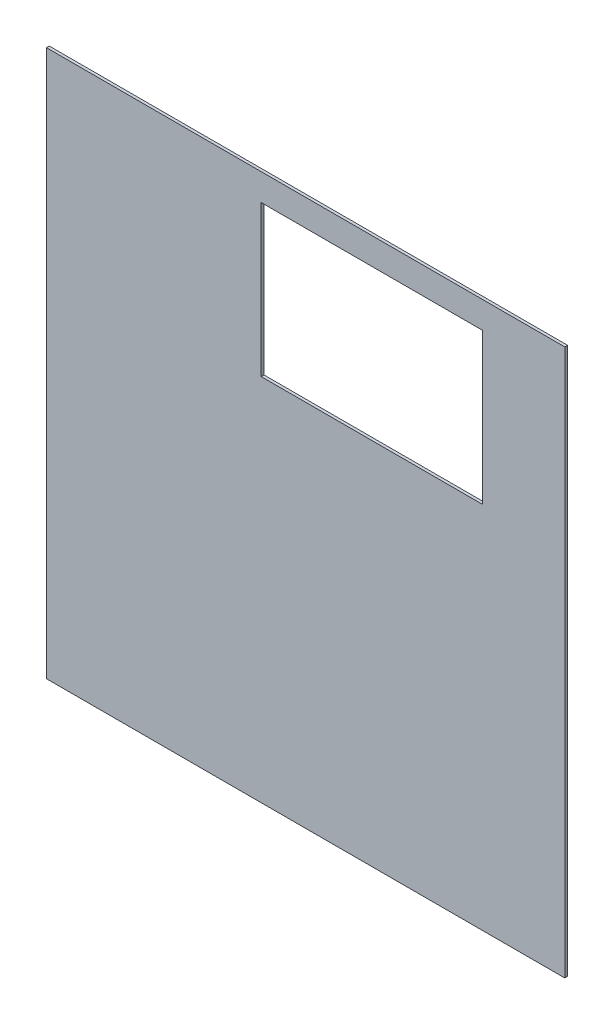
ISO-10303-21;
HEADER;
FILE_DESCRIPTION(('STEP AP214'),'2;1');
FILE_NAME('part.step','',(''),(''),'','','');
FILE_SCHEMA(('AUTOMOTIVE_DESIGN { 1 0 10303 214 1 1 1 1 }'));
ENDSEC;
DATA;
#1=APPLICATION_CONTEXT('core data for automotive mechanical design processes');
#2=APPLICATION_PROTOCOL_DEFINITION('international standard','automotive_design',2000,#1);
#3=PRODUCT_CONTEXT('',#1,'mechanical');
#4=PRODUCT('Part','Part','',(#3));
#5=PRODUCT_RELATED_PRODUCT_CATEGORY('part','',(#4));
#6=PRODUCT_DEFINITION_FORMATION('','',#4);
#7=PRODUCT_DEFINITION_CONTEXT('part definition',#1,'design');
#8=PRODUCT_DEFINITION('design','',#6,#7);
#9=PRODUCT_DEFINITION_SHAPE('','',#8);
#10=(LENGTH_UNIT() NAMED_UNIT(*) SI_UNIT(.MILLI.,.METRE.));
#11=(NAMED_UNIT(*) PLANE_ANGLE_UNIT() SI_UNIT($,.RADIAN.));
#12=(NAMED_UNIT(*) SI_UNIT($,.STERADIAN.) SOLID_ANGLE_UNIT());
#13=UNCERTAINTY_MEASURE_WITH_UNIT(LENGTH_MEASURE(1.E-05),#10,'distance_accuracy_value','');
#14=(GEOMETRIC_REPRESENTATION_CONTEXT(3) GLOBAL_UNCERTAINTY_ASSIGNED_CONTEXT((#13)) GLOBAL_UNIT_ASSIGNED_CONTEXT((#10,
#11,#12)) REPRESENTATION_CONTEXT('',''));
#15=CARTESIAN_POINT('',(0.,0.,0.));
#16=DIRECTION('',(0.,0.,1.));
#17=DIRECTION('',(1.,0.,0.));
#18=AXIS2_PLACEMENT_3D('',#15,#16,#17);
#19=CARTESIAN_POINT('',(184.,194.,0.));
#20=DIRECTION('',(0.,0.,1.));
#21=DIRECTION('',(1.,0.,0.));
#22=AXIS2_PLACEMENT_3D('',#19,#20,#21);
#23=PLANE('',#22);
#24=DIRECTION('',(1.,0.,0.));
#25=VECTOR('',#24,1.);
#26=CARTESIAN_POINT('',(309.5,262.,0.));
#27=LINE('',#26,#25);
#28=CARTESIAN_POINT('',(152.5,262.,0.));
#29=VERTEX_POINT('',#28);
#30=CARTESIAN_POINT('',(309.5,262.,0.));
#31=VERTEX_POINT('',#30);
#32=EDGE_CURVE('E143',#29,#31,#27,.T.);
#33=ORIENTED_EDGE('',*,*,#32,.T.);
#34=DIRECTION('',(0.,1.,0.));
#35=VECTOR('',#34,1.);
#36=CARTESIAN_POINT('',(309.5,369.,0.));
#37=LINE('',#36,#35);
#38=CARTESIAN_POINT('',(309.5,369.,0.));
#39=VERTEX_POINT('',#38);
#40=EDGE_CURVE('E133',#31,#39,#37,.T.);
#41=ORIENTED_EDGE('',*,*,#40,.T.);
#42=DIRECTION('',(1.,0.,0.));
#43=VECTOR('',#42,1.);
#44=CARTESIAN_POINT('',(152.5,369.,0.));
#45=LINE('',#44,#43);
#46=CARTESIAN_POINT('',(152.5,369.,0.));
#47=VERTEX_POINT('',#46);
#48=EDGE_CURVE('E126',#39,#47,#45,.F.);
#49=ORIENTED_EDGE('',*,*,#48,.T.);
#50=DIRECTION('',(0.,1.,0.));
#51=VECTOR('',#50,1.);
#52=CARTESIAN_POINT('',(152.5,262.,0.));
#53=LINE('',#52,#51);
#54=EDGE_CURVE('E121',#47,#29,#53,.F.);
#55=ORIENTED_EDGE('',*,*,#54,.T.);
#56=EDGE_LOOP('',(#33,#41,#49,#55));
#57=FACE_BOUND('',#56,.T.);
#58=DIRECTION('',(0.,1.,0.));
#59=VECTOR('',#58,1.);
#60=CARTESIAN_POINT('',(0.,388.,0.));
#61=LINE('',#60,#59);
#62=CARTESIAN_POINT('',(0.,388.,0.));
#63=VERTEX_POINT('',#62);
#64=CARTESIAN_POINT('',(0.,0.,0.));
#65=VERTEX_POINT('',#64);
#66=EDGE_CURVE('E112',#63,#65,#61,.F.);
#67=ORIENTED_EDGE('',*,*,#66,.F.);
#68=DIRECTION('',(1.,0.,0.));
#69=VECTOR('',#68,1.);
#70=CARTESIAN_POINT('',(368.,388.,0.));
#71=LINE('',#70,#69);
#72=CARTESIAN_POINT('',(368.,388.,0.));
#73=VERTEX_POINT('',#72);
#74=EDGE_CURVE('E80',#73,#63,#71,.F.);
#75=ORIENTED_EDGE('',*,*,#74,.F.);
#76=DIRECTION('',(0.,1.,0.));
#77=VECTOR('',#76,1.);
#78=CARTESIAN_POINT('',(368.,0.,0.));
#79=LINE('',#78,#77);
#80=CARTESIAN_POINT('',(368.,0.,0.));
#81=VERTEX_POINT('',#80);
#82=EDGE_CURVE('E82',#81,#73,#79,.T.);
#83=ORIENTED_EDGE('',*,*,#82,.F.);
#84=DIRECTION('',(1.,0.,0.));
#85=VECTOR('',#84,1.);
#86=CARTESIAN_POINT('',(0.,0.,0.));
#87=LINE('',#86,#85);
#88=EDGE_CURVE('E20',#65,#81,#87,.T.);
#89=ORIENTED_EDGE('',*,*,#88,.F.);
#90=EDGE_LOOP('',(#67,#75,#83,#89));
#91=FACE_BOUND('',#90,.T.);
#92=ADVANCED_FACE('F17',(#57,#91),#23,.F.);
#93=CARTESIAN_POINT('',(0.,0.,0.));
#94=DIRECTION('',(0.,-1.,0.));
#95=DIRECTION('',(0.,0.,-1.));
#96=AXIS2_PLACEMENT_3D('',#93,#94,#95);
#97=PLANE('',#96);
#98=DIRECTION('',(1.,0.,0.));
#99=VECTOR('',#98,1.);
#100=CARTESIAN_POINT('',(184.,0.,2.));
#101=LINE('',#100,#99);
#102=CARTESIAN_POINT('',(0.,0.,2.));
#103=VERTEX_POINT('',#102);
#104=CARTESIAN_POINT('',(368.,0.,2.));
#105=VERTEX_POINT('',#104);
#106=EDGE_CURVE('E147',#103,#105,#101,.T.);
#107=ORIENTED_EDGE('',*,*,#106,.F.);
#108=DIRECTION('',(0.,0.,1.));
#109=VECTOR('',#108,1.);
#110=CARTESIAN_POINT('',(0.,0.,0.));
#111=LINE('',#110,#109);
#112=EDGE_CURVE('E94',#65,#103,#111,.T.);
#113=ORIENTED_EDGE('',*,*,#112,.F.);
#114=ORIENTED_EDGE('',*,*,#88,.T.);
#115=DIRECTION('',(0.,0.,-1.));
#116=VECTOR('',#115,1.);
#117=CARTESIAN_POINT('',(368.,0.,0.));
#118=LINE('',#117,#116);
#119=EDGE_CURVE('E89',#105,#81,#118,.T.);
#120=ORIENTED_EDGE('',*,*,#119,.F.);
#121=EDGE_LOOP('',(#107,#113,#114,#120));
#122=FACE_BOUND('',#121,.T.);
#123=ADVANCED_FACE('F91',(#122),#97,.T.);
#124=CARTESIAN_POINT('',(368.,0.,0.));
#125=DIRECTION('',(1.,0.,0.));
#126=DIRECTION('',(0.,0.,-1.));
#127=AXIS2_PLACEMENT_3D('',#124,#125,#126);
#128=PLANE('',#127);
#129=DIRECTION('',(0.,1.,0.));
#130=VECTOR('',#129,1.);
#131=CARTESIAN_POINT('',(368.,194.,2.));
#132=LINE('',#131,#130);
#133=CARTESIAN_POINT('',(368.,388.,2.));
#134=VERTEX_POINT('',#133);
#135=EDGE_CURVE('E99',#105,#134,#132,.T.);
#136=ORIENTED_EDGE('',*,*,#135,.F.);
#137=ORIENTED_EDGE('',*,*,#119,.T.);
#138=ORIENTED_EDGE('',*,*,#82,.T.);
#139=DIRECTION('',(0.,0.,1.));
#140=VECTOR('',#139,1.);
#141=CARTESIAN_POINT('',(368.,388.,0.));
#142=LINE('',#141,#140);
#143=EDGE_CURVE('E107',#134,#73,#142,.F.);
#144=ORIENTED_EDGE('',*,*,#143,.F.);
#145=EDGE_LOOP('',(#136,#137,#138,#144));
#146=FACE_BOUND('',#145,.T.);
#147=ADVANCED_FACE('F97',(#146),#128,.T.);
#148=CARTESIAN_POINT('',(368.,388.,0.));
#149=DIRECTION('',(0.,1.,0.));
#150=DIRECTION('',(0.,0.,1.));
#151=AXIS2_PLACEMENT_3D('',#148,#149,#150);
#152=PLANE('',#151);
#153=DIRECTION('',(1.,0.,0.));
#154=VECTOR('',#153,1.);
#155=CARTESIAN_POINT('',(184.,388.,2.));
#156=LINE('',#155,#154);
#157=CARTESIAN_POINT('',(0.,388.,2.));
#158=VERTEX_POINT('',#157);
#159=EDGE_CURVE('E151',#134,#158,#156,.F.);
#160=ORIENTED_EDGE('',*,*,#159,.F.);
#161=ORIENTED_EDGE('',*,*,#143,.T.);
#162=ORIENTED_EDGE('',*,*,#74,.T.);
#163=DIRECTION('',(0.,0.,1.));
#164=VECTOR('',#163,1.);
#165=CARTESIAN_POINT('',(0.,388.,0.));
#166=LINE('',#165,#164);
#167=EDGE_CURVE('E117',#158,#63,#166,.F.);
#168=ORIENTED_EDGE('',*,*,#167,.F.);
#169=EDGE_LOOP('',(#160,#161,#162,#168));
#170=FACE_BOUND('',#169,.T.);
#171=ADVANCED_FACE('F194',(#170),#152,.T.);
#172=CARTESIAN_POINT('',(0.,388.,0.));
#173=DIRECTION('',(-1.,0.,0.));
#174=DIRECTION('',(0.,0.,1.));
#175=AXIS2_PLACEMENT_3D('',#172,#173,#174);
#176=PLANE('',#175);
#177=DIRECTION('',(0.,1.,0.));
#178=VECTOR('',#177,1.);
#179=CARTESIAN_POINT('',(0.,194.,2.));
#180=LINE('',#179,#178);
#181=EDGE_CURVE('E155',#158,#103,#180,.F.);
#182=ORIENTED_EDGE('',*,*,#181,.F.);
#183=ORIENTED_EDGE('',*,*,#167,.T.);
#184=ORIENTED_EDGE('',*,*,#66,.T.);
#185=ORIENTED_EDGE('',*,*,#112,.T.);
#186=EDGE_LOOP('',(#182,#183,#184,#185));
#187=FACE_BOUND('',#186,.T.);
#188=ADVANCED_FACE('F186',(#187),#176,.T.);
#189=CARTESIAN_POINT('',(152.5,262.,2.));
#190=DIRECTION('',(-1.,0.,0.));
#191=DIRECTION('',(0.,0.,1.));
#192=AXIS2_PLACEMENT_3D('',#189,#190,#191);
#193=PLANE('',#192);
#194=DIRECTION('',(0.,0.,1.));
#195=VECTOR('',#194,1.);
#196=CARTESIAN_POINT('',(152.5,369.,2.));
#197=LINE('',#196,#195);
#198=CARTESIAN_POINT('',(152.5,369.,2.));
#199=VERTEX_POINT('',#198);
#200=EDGE_CURVE('E123',#47,#199,#197,.T.);
#201=ORIENTED_EDGE('',*,*,#200,.T.);
#202=DIRECTION('',(0.,1.,0.));
#203=VECTOR('',#202,1.);
#204=CARTESIAN_POINT('',(152.5,194.,2.));
#205=LINE('',#204,#203);
#206=CARTESIAN_POINT('',(152.5,262.,2.));
#207=VERTEX_POINT('',#206);
#208=EDGE_CURVE('E159',#207,#199,#205,.T.);
#209=ORIENTED_EDGE('',*,*,#208,.F.);
#210=DIRECTION('',(0.,0.,1.));
#211=VECTOR('',#210,1.);
#212=CARTESIAN_POINT('',(152.5,262.,2.));
#213=LINE('',#212,#211);
#214=EDGE_CURVE('E139',#207,#29,#213,.F.);
#215=ORIENTED_EDGE('',*,*,#214,.T.);
#216=ORIENTED_EDGE('',*,*,#54,.F.);
#217=EDGE_LOOP('',(#201,#209,#215,#216));
#218=FACE_BOUND('',#217,.T.);
#219=ADVANCED_FACE('F184',(#218),#193,.F.);
#220=CARTESIAN_POINT('',(152.5,369.,2.));
#221=DIRECTION('',(0.,1.,0.));
#222=DIRECTION('',(0.,0.,1.));
#223=AXIS2_PLACEMENT_3D('',#220,#221,#222);
#224=PLANE('',#223);
#225=DIRECTION('',(0.,0.,1.));
#226=VECTOR('',#225,1.);
#227=CARTESIAN_POINT('',(309.5,369.,2.));
#228=LINE('',#227,#226);
#229=CARTESIAN_POINT('',(309.5,369.,2.));
#230=VERTEX_POINT('',#229);
#231=EDGE_CURVE('E130',#39,#230,#228,.T.);
#232=ORIENTED_EDGE('',*,*,#231,.T.);
#233=DIRECTION('',(1.,0.,0.));
#234=VECTOR('',#233,1.);
#235=CARTESIAN_POINT('',(184.,369.,2.));
#236=LINE('',#235,#234);
#237=EDGE_CURVE('E163',#199,#230,#236,.T.);
#238=ORIENTED_EDGE('',*,*,#237,.F.);
#239=ORIENTED_EDGE('',*,*,#200,.F.);
#240=ORIENTED_EDGE('',*,*,#48,.F.);
#241=EDGE_LOOP('',(#232,#238,#239,#240));
#242=FACE_BOUND('',#241,.T.);
#243=ADVANCED_FACE('F176',(#242),#224,.F.);
#244=CARTESIAN_POINT('',(309.5,369.,2.));
#245=DIRECTION('',(1.,0.,0.));
#246=DIRECTION('',(0.,1.,0.));
#247=AXIS2_PLACEMENT_3D('',#244,#245,#246);
#248=PLANE('',#247);
#249=DIRECTION('',(0.,0.,1.));
#250=VECTOR('',#249,1.);
#251=CARTESIAN_POINT('',(309.5,262.,2.));
#252=LINE('',#251,#250);
#253=CARTESIAN_POINT('',(309.5,262.,2.));
#254=VERTEX_POINT('',#253);
#255=EDGE_CURVE('E36',#31,#254,#252,.T.);
#256=ORIENTED_EDGE('',*,*,#255,.T.);
#257=DIRECTION('',(0.,1.,0.));
#258=VECTOR('',#257,1.);
#259=CARTESIAN_POINT('',(309.5,194.,2.));
#260=LINE('',#259,#258);
#261=EDGE_CURVE('E27',#230,#254,#260,.F.);
#262=ORIENTED_EDGE('',*,*,#261,.F.);
#263=ORIENTED_EDGE('',*,*,#231,.F.);
#264=ORIENTED_EDGE('',*,*,#40,.F.);
#265=EDGE_LOOP('',(#256,#262,#263,#264));
#266=FACE_BOUND('',#265,.T.);
#267=ADVANCED_FACE('F174',(#266),#248,.F.);
#268=CARTESIAN_POINT('',(309.5,262.,2.));
#269=DIRECTION('',(0.,-1.,0.));
#270=DIRECTION('',(1.,0.,0.));
#271=AXIS2_PLACEMENT_3D('',#268,#269,#270);
#272=PLANE('',#271);
#273=ORIENTED_EDGE('',*,*,#214,.F.);
#274=DIRECTION('',(1.,0.,0.));
#275=VECTOR('',#274,1.);
#276=CARTESIAN_POINT('',(184.,262.,2.));
#277=LINE('',#276,#275);
#278=EDGE_CURVE('E11',#254,#207,#277,.F.);
#279=ORIENTED_EDGE('',*,*,#278,.F.);
#280=ORIENTED_EDGE('',*,*,#255,.F.);
#281=ORIENTED_EDGE('',*,*,#32,.F.);
#282=EDGE_LOOP('',(#273,#279,#280,#281));
#283=FACE_BOUND('',#282,.T.);
#284=ADVANCED_FACE('F182',(#283),#272,.F.);
#285=CARTESIAN_POINT('',(184.,194.,2.));
#286=DIRECTION('',(0.,0.,1.));
#287=DIRECTION('',(1.,0.,0.));
#288=AXIS2_PLACEMENT_3D('',#285,#286,#287);
#289=PLANE('',#288);
#290=ORIENTED_EDGE('',*,*,#261,.T.);
#291=ORIENTED_EDGE('',*,*,#278,.T.);
#292=ORIENTED_EDGE('',*,*,#208,.T.);
#293=ORIENTED_EDGE('',*,*,#237,.T.);
#294=EDGE_LOOP('',(#290,#291,#292,#293));
#295=FACE_BOUND('',#294,.T.);
#296=ORIENTED_EDGE('',*,*,#159,.T.);
#297=ORIENTED_EDGE('',*,*,#181,.T.);
#298=ORIENTED_EDGE('',*,*,#106,.T.);
#299=ORIENTED_EDGE('',*,*,#135,.T.);
#300=EDGE_LOOP('',(#296,#297,#298,#299));
#301=FACE_BOUND('',#300,.T.);
#302=ADVANCED_FACE('F170',(#295,#301),#289,.T.);
#303=CLOSED_SHELL('',(#92,#123,#147,#171,#188,#219,#243,#267,#284,#302));
#304=MANIFOLD_SOLID_BREP('B1',#303);
#305=ADVANCED_BREP_SHAPE_REPRESENTATION('',(#18,#304),#14);
#306=SHAPE_DEFINITION_REPRESENTATION(#9,#305);
ENDSEC;
END-ISO-10303-21;
